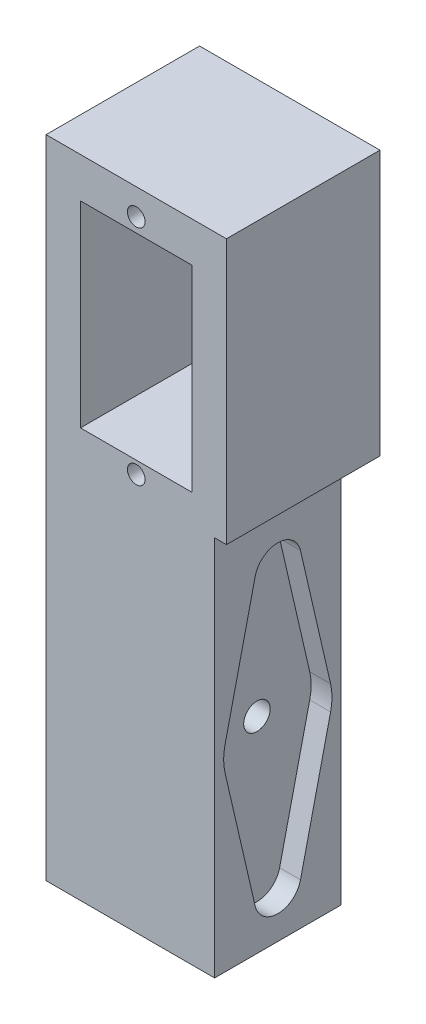
ISO-10303-21;
HEADER;
FILE_DESCRIPTION(('STEP AP214'),'2;1');
FILE_NAME('part.step','',(''),(''),'','','');
FILE_SCHEMA(('AUTOMOTIVE_DESIGN { 1 0 10303 214 1 1 1 1 }'));
ENDSEC;
DATA;
#1=APPLICATION_CONTEXT('core data for automotive mechanical design processes');
#2=APPLICATION_PROTOCOL_DEFINITION('international standard','automotive_design',2000,#1);
#3=PRODUCT_CONTEXT('',#1,'mechanical');
#4=PRODUCT('Part','Part','',(#3));
#5=PRODUCT_RELATED_PRODUCT_CATEGORY('part','',(#4));
#6=PRODUCT_DEFINITION_FORMATION('','',#4);
#7=PRODUCT_DEFINITION_CONTEXT('part definition',#1,'design');
#8=PRODUCT_DEFINITION('design','',#6,#7);
#9=PRODUCT_DEFINITION_SHAPE('','',#8);
#10=(LENGTH_UNIT() NAMED_UNIT(*) SI_UNIT(.MILLI.,.METRE.));
#11=(NAMED_UNIT(*) PLANE_ANGLE_UNIT() SI_UNIT($,.RADIAN.));
#12=(NAMED_UNIT(*) SI_UNIT($,.STERADIAN.) SOLID_ANGLE_UNIT());
#13=UNCERTAINTY_MEASURE_WITH_UNIT(LENGTH_MEASURE(1.E-05),#10,'distance_accuracy_value','');
#14=(GEOMETRIC_REPRESENTATION_CONTEXT(3) GLOBAL_UNCERTAINTY_ASSIGNED_CONTEXT((#13)) GLOBAL_UNIT_ASSIGNED_CONTEXT((#10,
#11,#12)) REPRESENTATION_CONTEXT('',''));
#15=CARTESIAN_POINT('',(0.,0.,0.));
#16=DIRECTION('',(0.,0.,1.));
#17=DIRECTION('',(1.,0.,0.));
#18=AXIS2_PLACEMENT_3D('',#15,#16,#17);
#19=CARTESIAN_POINT('',(-36.35,13.,-6.87499999999982));
#20=DIRECTION('',(1.,0.,0.));
#21=DIRECTION('',(0.,0.,-1.));
#22=AXIS2_PLACEMENT_3D('',#19,#20,#21);
#23=CYLINDRICAL_SURFACE('',#22,1.65);
#24=CARTESIAN_POINT('',(-7.34999999999999,13.,-6.87499999999992));
#25=DIRECTION('',(1.,0.,0.));
#26=DIRECTION('',(0.,0.,-1.));
#27=AXIS2_PLACEMENT_3D('',#24,#25,#26);
#28=CIRCLE('',#27,1.65);
#29=CARTESIAN_POINT('',(-7.34999999999999,13.,-8.52499999999993));
#30=VERTEX_POINT('',#29);
#31=EDGE_CURVE('E292',#30,#30,#28,.T.);
#32=ORIENTED_EDGE('',*,*,#31,.F.);
#33=EDGE_LOOP('',(#32));
#34=FACE_BOUND('',#33,.T.);
#35=CARTESIAN_POINT('',(11.05,13.,-6.87499999999999));
#36=DIRECTION('',(1.,0.,0.));
#37=DIRECTION('',(0.,0.,-1.));
#38=AXIS2_PLACEMENT_3D('',#35,#36,#37);
#39=CIRCLE('',#38,1.65);
#40=CARTESIAN_POINT('',(11.05,13.,-8.52499999999999));
#41=VERTEX_POINT('',#40);
#42=EDGE_CURVE('E40',#41,#41,#39,.F.);
#43=ORIENTED_EDGE('',*,*,#42,.F.);
#44=EDGE_LOOP('',(#43));
#45=FACE_BOUND('',#44,.T.);
#46=ADVANCED_FACE('F36',(#34,#45),#23,.F.);
#47=CARTESIAN_POINT('',(0.,0.,1.));
#48=DIRECTION('',(0.,0.,1.));
#49=DIRECTION('',(1.,0.,0.));
#50=AXIS2_PLACEMENT_3D('',#47,#48,#49);
#51=PLANE('',#50);
#52=CARTESIAN_POINT('',(3.88750000000004,67.25,1.));
#53=DIRECTION('',(0.,0.,1.));
#54=DIRECTION('',(1.,0.,0.));
#55=AXIS2_PLACEMENT_3D('',#52,#53,#54);
#56=CIRCLE('',#55,1.1);
#57=CARTESIAN_POINT('',(4.98750000000004,67.25,1.));
#58=VERTEX_POINT('',#57);
#59=EDGE_CURVE('E380',#58,#58,#56,.T.);
#60=ORIENTED_EDGE('',*,*,#59,.F.);
#61=EDGE_LOOP('',(#60));
#62=FACE_BOUND('',#61,.T.);
#63=CARTESIAN_POINT('',(3.88750000000004,39.45,1.));
#64=DIRECTION('',(0.,0.,1.));
#65=DIRECTION('',(1.,0.,0.));
#66=AXIS2_PLACEMENT_3D('',#63,#64,#65);
#67=CIRCLE('',#66,1.1);
#68=CARTESIAN_POINT('',(4.98750000000004,39.45,1.));
#69=VERTEX_POINT('',#68);
#70=EDGE_CURVE('E385',#69,#69,#67,.T.);
#71=ORIENTED_EDGE('',*,*,#70,.F.);
#72=EDGE_LOOP('',(#71));
#73=FACE_BOUND('',#72,.T.);
#74=DIRECTION('',(-1.,0.,0.));
#75=VECTOR('',#74,1.);
#76=CARTESIAN_POINT('',(-1.,-10.,1.));
#77=LINE('',#76,#75);
#78=CARTESIAN_POINT('',(13.65,-10.,1.));
#79=VERTEX_POINT('',#78);
#80=CARTESIAN_POINT('',(-7.34999999999996,-10.,1.));
#81=VERTEX_POINT('',#80);
#82=EDGE_CURVE('E288',#79,#81,#77,.T.);
#83=ORIENTED_EDGE('',*,*,#82,.F.);
#84=DIRECTION('',(0.,1.,0.));
#85=VECTOR('',#84,1.);
#86=CARTESIAN_POINT('',(13.65,37.5,1.));
#87=LINE('',#86,#85);
#88=CARTESIAN_POINT('',(13.65,37.5,1.));
#89=VERTEX_POINT('',#88);
#90=EDGE_CURVE('E404',#79,#89,#87,.T.);
#91=ORIENTED_EDGE('',*,*,#90,.T.);
#92=DIRECTION('',(1.,0.,0.));
#93=VECTOR('',#92,1.);
#94=CARTESIAN_POINT('',(-7.34999999999996,37.5,1.));
#95=LINE('',#94,#93);
#96=CARTESIAN_POINT('',(15.125,37.5,1.));
#97=VERTEX_POINT('',#96);
#98=EDGE_CURVE('E407',#89,#97,#95,.T.);
#99=ORIENTED_EDGE('',*,*,#98,.T.);
#100=DIRECTION('',(0.,1.,0.));
#101=VECTOR('',#100,1.);
#102=CARTESIAN_POINT('',(15.125,37.5,1.));
#103=LINE('',#102,#101);
#104=CARTESIAN_POINT('',(15.125,70.5,1.));
#105=VERTEX_POINT('',#104);
#106=EDGE_CURVE('E409',#97,#105,#103,.T.);
#107=ORIENTED_EDGE('',*,*,#106,.T.);
#108=DIRECTION('',(1.,0.,0.));
#109=VECTOR('',#108,1.);
#110=CARTESIAN_POINT('',(15.125,70.5,1.));
#111=LINE('',#110,#109);
#112=CARTESIAN_POINT('',(-7.34999999999996,70.5,1.));
#113=VERTEX_POINT('',#112);
#114=EDGE_CURVE('E401',#113,#105,#111,.T.);
#115=ORIENTED_EDGE('',*,*,#114,.F.);
#116=DIRECTION('',(0.,-1.,0.));
#117=VECTOR('',#116,1.);
#118=CARTESIAN_POINT('',(-7.34999999999996,68.5,1.));
#119=LINE('',#118,#117);
#120=EDGE_CURVE('E411',#113,#81,#119,.T.);
#121=ORIENTED_EDGE('',*,*,#120,.T.);
#122=EDGE_LOOP('',(#83,#91,#99,#107,#115,#121));
#123=FACE_BOUND('',#122,.T.);
#124=DIRECTION('',(0.,1.,0.));
#125=VECTOR('',#124,1.);
#126=CARTESIAN_POINT('',(10.8375,0.,1.));
#127=LINE('',#126,#125);
#128=CARTESIAN_POINT('',(10.8375,41.,1.));
#129=VERTEX_POINT('',#128);
#130=CARTESIAN_POINT('',(10.8375,65.5,1.));
#131=VERTEX_POINT('',#130);
#132=EDGE_CURVE('E320',#129,#131,#127,.T.);
#133=ORIENTED_EDGE('',*,*,#132,.F.);
#134=DIRECTION('',(-1.,0.,0.));
#135=VECTOR('',#134,1.);
#136=CARTESIAN_POINT('',(0.,41.,1.));
#137=LINE('',#136,#135);
#138=CARTESIAN_POINT('',(-3.06249999999996,41.,1.));
#139=VERTEX_POINT('',#138);
#140=EDGE_CURVE('E317',#129,#139,#137,.T.);
#141=ORIENTED_EDGE('',*,*,#140,.T.);
#142=DIRECTION('',(0.,1.,0.));
#143=VECTOR('',#142,1.);
#144=CARTESIAN_POINT('',(-3.06249999999996,0.,1.));
#145=LINE('',#144,#143);
#146=CARTESIAN_POINT('',(-3.06249999999996,65.5,1.));
#147=VERTEX_POINT('',#146);
#148=EDGE_CURVE('E314',#139,#147,#145,.T.);
#149=ORIENTED_EDGE('',*,*,#148,.T.);
#150=DIRECTION('',(1.,0.,0.));
#151=VECTOR('',#150,1.);
#152=CARTESIAN_POINT('',(0.,65.5,1.));
#153=LINE('',#152,#151);
#154=EDGE_CURVE('E61',#147,#131,#153,.T.);
#155=ORIENTED_EDGE('',*,*,#154,.T.);
#156=EDGE_LOOP('',(#133,#141,#149,#155));
#157=FACE_BOUND('',#156,.T.);
#158=ADVANCED_FACE('F453',(#62,#73,#123,#157),#51,.T.);
#159=CARTESIAN_POINT('',(0.,0.,-14.625));
#160=DIRECTION('',(0.,0.,-1.));
#161=DIRECTION('',(-1.,0.,0.));
#162=AXIS2_PLACEMENT_3D('',#159,#160,#161);
#163=PLANE('',#162);
#164=DIRECTION('',(0.,-1.,0.));
#165=VECTOR('',#164,1.);
#166=CARTESIAN_POINT('',(-1.61249999999995,0.,-14.625));
#167=LINE('',#166,#165);
#168=CARTESIAN_POINT('',(-1.61249999999996,64.5,-14.625));
#169=VERTEX_POINT('',#168);
#170=CARTESIAN_POINT('',(-1.61249999999996,59.5,-14.625));
#171=VERTEX_POINT('',#170);
#172=EDGE_CURVE('E362',#169,#171,#167,.T.);
#173=ORIENTED_EDGE('',*,*,#172,.F.);
#174=DIRECTION('',(1.,0.,0.));
#175=VECTOR('',#174,1.);
#176=CARTESIAN_POINT('',(0.,64.5,-14.625));
#177=LINE('',#176,#175);
#178=CARTESIAN_POINT('',(9.38750000000004,64.5,-14.625));
#179=VERTEX_POINT('',#178);
#180=EDGE_CURVE('E327',#169,#179,#177,.T.);
#181=ORIENTED_EDGE('',*,*,#180,.T.);
#182=DIRECTION('',(0.,1.,0.));
#183=VECTOR('',#182,1.);
#184=CARTESIAN_POINT('',(9.38750000000004,0.,-14.625));
#185=LINE('',#184,#183);
#186=CARTESIAN_POINT('',(9.38750000000004,59.5,-14.625));
#187=VERTEX_POINT('',#186);
#188=EDGE_CURVE('E359',#187,#179,#185,.T.);
#189=ORIENTED_EDGE('',*,*,#188,.F.);
#190=DIRECTION('',(1.,0.,0.));
#191=VECTOR('',#190,1.);
#192=CARTESIAN_POINT('',(0.,59.5,-14.625));
#193=LINE('',#192,#191);
#194=EDGE_CURVE('E334',#171,#187,#193,.T.);
#195=ORIENTED_EDGE('',*,*,#194,.F.);
#196=EDGE_LOOP('',(#173,#181,#189,#195));
#197=FACE_BOUND('',#196,.T.);
#198=DIRECTION('',(0.,-1.,0.));
#199=VECTOR('',#198,1.);
#200=CARTESIAN_POINT('',(9.38750000000004,0.,-14.625));
#201=LINE('',#200,#199);
#202=CARTESIAN_POINT('',(9.38750000000004,47.,-14.625));
#203=VERTEX_POINT('',#202);
#204=CARTESIAN_POINT('',(9.38750000000004,42.,-14.625));
#205=VERTEX_POINT('',#204);
#206=EDGE_CURVE('E335',#203,#205,#201,.T.);
#207=ORIENTED_EDGE('',*,*,#206,.T.);
#208=DIRECTION('',(-1.,0.,0.));
#209=VECTOR('',#208,1.);
#210=CARTESIAN_POINT('',(0.,42.,-14.625));
#211=LINE('',#210,#209);
#212=CARTESIAN_POINT('',(-1.61249999999996,42.,-14.625));
#213=VERTEX_POINT('',#212);
#214=EDGE_CURVE('E301',#205,#213,#211,.T.);
#215=ORIENTED_EDGE('',*,*,#214,.T.);
#216=DIRECTION('',(0.,1.,0.));
#217=VECTOR('',#216,1.);
#218=CARTESIAN_POINT('',(-1.61249999999996,0.,-14.625));
#219=LINE('',#218,#217);
#220=CARTESIAN_POINT('',(-1.61249999999996,47.,-14.625));
#221=VERTEX_POINT('',#220);
#222=EDGE_CURVE('E342',#213,#221,#219,.T.);
#223=ORIENTED_EDGE('',*,*,#222,.T.);
#224=DIRECTION('',(1.,0.,0.));
#225=VECTOR('',#224,1.);
#226=CARTESIAN_POINT('',(0.,47.,-14.625));
#227=LINE('',#226,#225);
#228=EDGE_CURVE('E338',#221,#203,#227,.T.);
#229=ORIENTED_EDGE('',*,*,#228,.T.);
#230=EDGE_LOOP('',(#207,#215,#223,#229));
#231=FACE_BOUND('',#230,.T.);
#232=DIRECTION('',(-1.,0.,0.));
#233=VECTOR('',#232,1.);
#234=CARTESIAN_POINT('',(0.,41.,-14.625));
#235=LINE('',#234,#233);
#236=CARTESIAN_POINT('',(10.8375,41.,-14.625));
#237=VERTEX_POINT('',#236);
#238=CARTESIAN_POINT('',(-3.06249999999996,41.,-14.625));
#239=VERTEX_POINT('',#238);
#240=EDGE_CURVE('E303',#237,#239,#235,.T.);
#241=ORIENTED_EDGE('',*,*,#240,.F.);
#242=DIRECTION('',(0.,1.,0.));
#243=VECTOR('',#242,1.);
#244=CARTESIAN_POINT('',(10.8375,0.,-14.625));
#245=LINE('',#244,#243);
#246=CARTESIAN_POINT('',(10.8375,65.5,-14.625));
#247=VERTEX_POINT('',#246);
#248=EDGE_CURVE('E306',#237,#247,#245,.T.);
#249=ORIENTED_EDGE('',*,*,#248,.T.);
#250=DIRECTION('',(1.,0.,0.));
#251=VECTOR('',#250,1.);
#252=CARTESIAN_POINT('',(0.,65.5,-14.625));
#253=LINE('',#252,#251);
#254=CARTESIAN_POINT('',(-3.06249999999996,65.5,-14.625));
#255=VERTEX_POINT('',#254);
#256=EDGE_CURVE('E308',#255,#247,#253,.T.);
#257=ORIENTED_EDGE('',*,*,#256,.F.);
#258=DIRECTION('',(0.,1.,0.));
#259=VECTOR('',#258,1.);
#260=CARTESIAN_POINT('',(-3.06249999999996,0.,-14.625));
#261=LINE('',#260,#259);
#262=EDGE_CURVE('E311',#239,#255,#261,.T.);
#263=ORIENTED_EDGE('',*,*,#262,.F.);
#264=EDGE_LOOP('',(#241,#249,#257,#263));
#265=FACE_BOUND('',#264,.T.);
#266=ADVANCED_FACE('F459',(#197,#231,#265),#163,.F.);
#267=CARTESIAN_POINT('',(0.,0.,-18.125));
#268=DIRECTION('',(0.,0.,1.));
#269=DIRECTION('',(1.,0.,0.));
#270=AXIS2_PLACEMENT_3D('',#267,#268,#269);
#271=PLANE('',#270);
#272=DIRECTION('',(-1.,0.,0.));
#273=VECTOR('',#272,1.);
#274=CARTESIAN_POINT('',(-7.34999999999997,37.5,-18.125));
#275=LINE('',#274,#273);
#276=CARTESIAN_POINT('',(15.125,37.5,-18.125));
#277=VERTEX_POINT('',#276);
#278=CARTESIAN_POINT('',(-7.34999999999997,37.5,-18.125));
#279=VERTEX_POINT('',#278);
#280=EDGE_CURVE('E413',#277,#279,#275,.T.);
#281=ORIENTED_EDGE('',*,*,#280,.T.);
#282=DIRECTION('',(0.,1.,0.));
#283=VECTOR('',#282,1.);
#284=CARTESIAN_POINT('',(-7.34999999999996,68.5,-18.125));
#285=LINE('',#284,#283);
#286=CARTESIAN_POINT('',(-7.34999999999996,70.5,-18.125));
#287=VERTEX_POINT('',#286);
#288=EDGE_CURVE('E416',#279,#287,#285,.T.);
#289=ORIENTED_EDGE('',*,*,#288,.T.);
#290=DIRECTION('',(-1.,0.,0.));
#291=VECTOR('',#290,1.);
#292=CARTESIAN_POINT('',(-7.34999999999996,70.5,-18.125));
#293=LINE('',#292,#291);
#294=CARTESIAN_POINT('',(15.125,70.5,-18.125));
#295=VERTEX_POINT('',#294);
#296=EDGE_CURVE('E395',#295,#287,#293,.T.);
#297=ORIENTED_EDGE('',*,*,#296,.F.);
#298=DIRECTION('',(0.,-1.,0.));
#299=VECTOR('',#298,1.);
#300=CARTESIAN_POINT('',(15.125,37.5,-18.125));
#301=LINE('',#300,#299);
#302=EDGE_CURVE('E418',#295,#277,#301,.T.);
#303=ORIENTED_EDGE('',*,*,#302,.T.);
#304=EDGE_LOOP('',(#281,#289,#297,#303));
#305=FACE_BOUND('',#304,.T.);
#306=DIRECTION('',(0.,-1.,0.));
#307=VECTOR('',#306,1.);
#308=CARTESIAN_POINT('',(-1.61249999999995,0.,-18.125));
#309=LINE('',#308,#307);
#310=CARTESIAN_POINT('',(-1.61249999999996,64.5,-18.125));
#311=VERTEX_POINT('',#310);
#312=CARTESIAN_POINT('',(-1.61249999999996,59.5,-18.125));
#313=VERTEX_POINT('',#312);
#314=EDGE_CURVE('E434',#311,#313,#309,.T.);
#315=ORIENTED_EDGE('',*,*,#314,.T.);
#316=DIRECTION('',(1.,0.,0.));
#317=VECTOR('',#316,1.);
#318=CARTESIAN_POINT('',(0.,59.5,-18.125));
#319=LINE('',#318,#317);
#320=CARTESIAN_POINT('',(9.38750000000004,59.5,-18.125));
#321=VERTEX_POINT('',#320);
#322=EDGE_CURVE('E437',#313,#321,#319,.T.);
#323=ORIENTED_EDGE('',*,*,#322,.T.);
#324=DIRECTION('',(0.,1.,0.));
#325=VECTOR('',#324,1.);
#326=CARTESIAN_POINT('',(9.38750000000004,0.,-18.125));
#327=LINE('',#326,#325);
#328=CARTESIAN_POINT('',(9.38750000000004,64.5,-18.125));
#329=VERTEX_POINT('',#328);
#330=EDGE_CURVE('E428',#321,#329,#327,.T.);
#331=ORIENTED_EDGE('',*,*,#330,.T.);
#332=DIRECTION('',(-1.,0.,0.));
#333=VECTOR('',#332,1.);
#334=CARTESIAN_POINT('',(0.,64.5,-18.125));
#335=LINE('',#334,#333);
#336=EDGE_CURVE('E431',#329,#311,#335,.T.);
#337=ORIENTED_EDGE('',*,*,#336,.T.);
#338=EDGE_LOOP('',(#315,#323,#331,#337));
#339=FACE_BOUND('',#338,.T.);
#340=DIRECTION('',(0.,-1.,0.));
#341=VECTOR('',#340,1.);
#342=CARTESIAN_POINT('',(9.38750000000004,0.,-18.125));
#343=LINE('',#342,#341);
#344=CARTESIAN_POINT('',(9.38750000000004,47.,-18.125));
#345=VERTEX_POINT('',#344);
#346=CARTESIAN_POINT('',(9.38750000000004,42.,-18.125));
#347=VERTEX_POINT('',#346);
#348=EDGE_CURVE('E12',#345,#347,#343,.T.);
#349=ORIENTED_EDGE('',*,*,#348,.F.);
#350=DIRECTION('',(1.,0.,0.));
#351=VECTOR('',#350,1.);
#352=CARTESIAN_POINT('',(0.,47.,-18.125));
#353=LINE('',#352,#351);
#354=CARTESIAN_POINT('',(-1.61249999999996,47.,-18.125));
#355=VERTEX_POINT('',#354);
#356=EDGE_CURVE('E440',#355,#345,#353,.T.);
#357=ORIENTED_EDGE('',*,*,#356,.F.);
#358=DIRECTION('',(0.,1.,0.));
#359=VECTOR('',#358,1.);
#360=CARTESIAN_POINT('',(-1.61249999999996,0.,-18.125));
#361=LINE('',#360,#359);
#362=CARTESIAN_POINT('',(-1.61249999999996,42.,-18.125));
#363=VERTEX_POINT('',#362);
#364=EDGE_CURVE('E442',#363,#355,#361,.T.);
#365=ORIENTED_EDGE('',*,*,#364,.F.);
#366=DIRECTION('',(1.,0.,0.));
#367=VECTOR('',#366,1.);
#368=CARTESIAN_POINT('',(0.,42.,-18.125));
#369=LINE('',#368,#367);
#370=EDGE_CURVE('E45',#363,#347,#369,.T.);
#371=ORIENTED_EDGE('',*,*,#370,.T.);
#372=EDGE_LOOP('',(#349,#357,#365,#371));
#373=FACE_BOUND('',#372,.T.);
#374=ADVANCED_FACE('F532',(#305,#339,#373),#271,.F.);
#375=CARTESIAN_POINT('',(-1.,37.5,-38.9531761207504));
#376=DIRECTION('',(0.,-1.,0.));
#377=DIRECTION('',(0.,0.,-1.));
#378=AXIS2_PLACEMENT_3D('',#375,#376,#377);
#379=PLANE('',#378);
#380=DIRECTION('',(0.,0.,-1.));
#381=VECTOR('',#380,1.);
#382=CARTESIAN_POINT('',(13.65,37.5,0.));
#383=LINE('',#382,#381);
#384=CARTESIAN_POINT('',(13.65,37.5,-14.75));
#385=VERTEX_POINT('',#384);
#386=EDGE_CURVE('E426',#89,#385,#383,.T.);
#387=ORIENTED_EDGE('',*,*,#386,.T.);
#388=DIRECTION('',(1.,0.,0.));
#389=VECTOR('',#388,1.);
#390=CARTESIAN_POINT('',(-7.35,37.5,-14.75));
#391=LINE('',#390,#389);
#392=CARTESIAN_POINT('',(-7.35,37.5,-14.75));
#393=VERTEX_POINT('',#392);
#394=EDGE_CURVE('E377',#393,#385,#391,.T.);
#395=ORIENTED_EDGE('',*,*,#394,.F.);
#396=DIRECTION('',(0.,0.,-1.));
#397=VECTOR('',#396,1.);
#398=CARTESIAN_POINT('',(-7.34999999999997,37.5,-4.92559526405419));
#399=LINE('',#398,#397);
#400=EDGE_CURVE('E421',#393,#279,#399,.T.);
#401=ORIENTED_EDGE('',*,*,#400,.T.);
#402=ORIENTED_EDGE('',*,*,#280,.F.);
#403=DIRECTION('',(0.,0.,1.));
#404=VECTOR('',#403,1.);
#405=CARTESIAN_POINT('',(15.125,37.5,-38.9531761207504));
#406=LINE('',#405,#404);
#407=EDGE_CURVE('E423',#277,#97,#406,.T.);
#408=ORIENTED_EDGE('',*,*,#407,.T.);
#409=ORIENTED_EDGE('',*,*,#98,.F.);
#410=EDGE_LOOP('',(#387,#395,#401,#402,#408,#409));
#411=FACE_BOUND('',#410,.T.);
#412=ADVANCED_FACE('F535',(#411),#379,.T.);
#413=CARTESIAN_POINT('',(13.65,0.,0.));
#414=DIRECTION('',(1.,0.,0.));
#415=DIRECTION('',(0.,0.,-1.));
#416=AXIS2_PLACEMENT_3D('',#413,#414,#415);
#417=PLANE('',#416);
#418=CARTESIAN_POINT('',(13.65,-4.1,-6.875));
#419=DIRECTION('',(1.,0.,0.));
#420=DIRECTION('',(0.,0.,-1.));
#421=AXIS2_PLACEMENT_3D('',#418,#419,#420);
#422=CIRCLE('',#421,2.9);
#423=CARTESIAN_POINT('',(13.65,-4.75292397660819,-4.04945752451496));
#424=VERTEX_POINT('',#423);
#425=CARTESIAN_POINT('',(13.65,-4.75292397660819,-9.70054247548505));
#426=VERTEX_POINT('',#425);
#427=EDGE_CURVE('E53',#424,#426,#422,.T.);
#428=ORIENTED_EDGE('',*,*,#427,.F.);
#429=DIRECTION('',(0.,-0.974324991546567,-0.22514619883041));
#430=VECTOR('',#429,1.);
#431=CARTESIAN_POINT('',(13.65,-4.75292397660819,-4.04945752451496));
#432=LINE('',#431,#430);
#433=CARTESIAN_POINT('',(13.65,11.4802631578947,-0.298306307060673));
#434=VERTEX_POINT('',#433);
#435=EDGE_CURVE('E239',#434,#424,#432,.T.);
#436=ORIENTED_EDGE('',*,*,#435,.F.);
#437=CARTESIAN_POINT('',(13.65,13.,-6.875));
#438=DIRECTION('',(1.,0.,0.));
#439=DIRECTION('',(0.,0.,-1.));
#440=AXIS2_PLACEMENT_3D('',#437,#438,#439);
#441=CIRCLE('',#440,6.75);
#442=CARTESIAN_POINT('',(13.65,14.5173795873099,-0.297762039578077));
#443=VERTEX_POINT('',#442);
#444=EDGE_CURVE('E242',#443,#434,#441,.T.);
#445=ORIENTED_EDGE('',*,*,#444,.F.);
#446=DIRECTION('',(0.,-0.974405623766211,0.224796975897769));
#447=VECTOR('',#446,1.);
#448=CARTESIAN_POINT('',(13.65,14.5173795873099,-0.297762039578078));
#449=LINE('',#448,#447);
#450=CARTESIAN_POINT('',(13.65,30.7784761432849,-4.04922369107799));
#451=VERTEX_POINT('',#450);
#452=EDGE_CURVE('E270',#451,#443,#449,.T.);
#453=ORIENTED_EDGE('',*,*,#452,.F.);
#454=CARTESIAN_POINT('',(13.65,30.1265649131813,-6.875));
#455=DIRECTION('',(1.,0.,0.));
#456=DIRECTION('',(0.,0.,-1.));
#457=AXIS2_PLACEMENT_3D('',#454,#455,#456);
#458=CIRCLE('',#457,2.9);
#459=CARTESIAN_POINT('',(13.65,30.7784761432849,-9.70077630892201));
#460=VERTEX_POINT('',#459);
#461=EDGE_CURVE('E267',#460,#451,#458,.T.);
#462=ORIENTED_EDGE('',*,*,#461,.F.);
#463=DIRECTION('',(0.,0.974405623766211,0.224796975897769));
#464=VECTOR('',#463,1.);
#465=CARTESIAN_POINT('',(13.65,14.5173795873099,-13.4522379604219));
#466=LINE('',#465,#464);
#467=CARTESIAN_POINT('',(13.65,14.5173795873099,-13.4522379604219));
#468=VERTEX_POINT('',#467);
#469=EDGE_CURVE('E264',#468,#460,#466,.T.);
#470=ORIENTED_EDGE('',*,*,#469,.F.);
#471=CARTESIAN_POINT('',(13.65,13.,-6.875));
#472=DIRECTION('',(1.,0.,0.));
#473=DIRECTION('',(0.,0.,-1.));
#474=AXIS2_PLACEMENT_3D('',#471,#472,#473);
#475=CIRCLE('',#474,6.75);
#476=CARTESIAN_POINT('',(13.65,11.4802631578947,-13.4516936929393));
#477=VERTEX_POINT('',#476);
#478=EDGE_CURVE('E261',#477,#468,#475,.T.);
#479=ORIENTED_EDGE('',*,*,#478,.F.);
#480=DIRECTION('',(0.,0.974324991546567,-0.225146198830409));
#481=VECTOR('',#480,1.);
#482=CARTESIAN_POINT('',(13.65,-4.75292397660819,-9.70054247548505));
#483=LINE('',#482,#481);
#484=EDGE_CURVE('E259',#426,#477,#483,.T.);
#485=ORIENTED_EDGE('',*,*,#484,.F.);
#486=EDGE_LOOP('',(#428,#436,#445,#453,#462,#470,#479,#485));
#487=FACE_BOUND('',#486,.T.);
#488=ORIENTED_EDGE('',*,*,#386,.F.);
#489=ORIENTED_EDGE('',*,*,#90,.F.);
#490=DIRECTION('',(0.,0.,1.));
#491=VECTOR('',#490,1.);
#492=CARTESIAN_POINT('',(13.65,-10.,-14.75));
#493=LINE('',#492,#491);
#494=CARTESIAN_POINT('',(13.65,-10.,-14.75));
#495=VERTEX_POINT('',#494);
#496=EDGE_CURVE('E298',#495,#79,#493,.T.);
#497=ORIENTED_EDGE('',*,*,#496,.F.);
#498=DIRECTION('',(0.,-1.,0.));
#499=VECTOR('',#498,1.);
#500=CARTESIAN_POINT('',(13.65,37.5,-14.75));
#501=LINE('',#500,#499);
#502=EDGE_CURVE('E349',#385,#495,#501,.T.);
#503=ORIENTED_EDGE('',*,*,#502,.F.);
#504=EDGE_LOOP('',(#488,#489,#497,#503));
#505=FACE_BOUND('',#504,.T.);
#506=ADVANCED_FACE('F539',(#487,#505),#417,.T.);
#507=CARTESIAN_POINT('',(15.125,0.,0.));
#508=DIRECTION('',(1.,0.,0.));
#509=DIRECTION('',(0.,0.,-1.));
#510=AXIS2_PLACEMENT_3D('',#507,#508,#509);
#511=PLANE('',#510);
#512=ORIENTED_EDGE('',*,*,#302,.F.);
#513=DIRECTION('',(0.,0.,-1.));
#514=VECTOR('',#513,1.);
#515=CARTESIAN_POINT('',(15.125,70.5,-18.125));
#516=LINE('',#515,#514);
#517=EDGE_CURVE('E384',#105,#295,#516,.T.);
#518=ORIENTED_EDGE('',*,*,#517,.F.);
#519=ORIENTED_EDGE('',*,*,#106,.F.);
#520=ORIENTED_EDGE('',*,*,#407,.F.);
#521=EDGE_LOOP('',(#512,#518,#519,#520));
#522=FACE_BOUND('',#521,.T.);
#523=ADVANCED_FACE('F545',(#522),#511,.T.);
#524=CARTESIAN_POINT('',(-7.34999999999996,0.,0.));
#525=DIRECTION('',(1.,0.,0.));
#526=DIRECTION('',(0.,0.,-1.));
#527=AXIS2_PLACEMENT_3D('',#524,#525,#526);
#528=PLANE('',#527);
#529=ORIENTED_EDGE('',*,*,#31,.T.);
#530=EDGE_LOOP('',(#529));
#531=FACE_BOUND('',#530,.T.);
#532=ORIENTED_EDGE('',*,*,#400,.F.);
#533=DIRECTION('',(0.,1.,0.));
#534=VECTOR('',#533,1.);
#535=CARTESIAN_POINT('',(-7.35,0.,-14.75));
#536=LINE('',#535,#534);
#537=CARTESIAN_POINT('',(-7.35,-10.,-14.75));
#538=VERTEX_POINT('',#537);
#539=EDGE_CURVE('E375',#538,#393,#536,.T.);
#540=ORIENTED_EDGE('',*,*,#539,.F.);
#541=DIRECTION('',(0.,0.,-1.));
#542=VECTOR('',#541,1.);
#543=CARTESIAN_POINT('',(-7.34999999999996,-10.,1.));
#544=LINE('',#543,#542);
#545=EDGE_CURVE('E291',#81,#538,#544,.T.);
#546=ORIENTED_EDGE('',*,*,#545,.F.);
#547=ORIENTED_EDGE('',*,*,#120,.F.);
#548=DIRECTION('',(0.,0.,1.));
#549=VECTOR('',#548,1.);
#550=CARTESIAN_POINT('',(-7.34999999999996,70.5,1.));
#551=LINE('',#550,#549);
#552=EDGE_CURVE('E398',#287,#113,#551,.T.);
#553=ORIENTED_EDGE('',*,*,#552,.F.);
#554=ORIENTED_EDGE('',*,*,#288,.F.);
#555=EDGE_LOOP('',(#532,#540,#546,#547,#553,#554));
#556=FACE_BOUND('',#555,.T.);
#557=ADVANCED_FACE('F541',(#531,#556),#528,.F.);
#558=CARTESIAN_POINT('',(0.,64.5,0.));
#559=DIRECTION('',(0.,-1.,0.));
#560=DIRECTION('',(0.,0.,-1.));
#561=AXIS2_PLACEMENT_3D('',#558,#559,#560);
#562=PLANE('',#561);
#563=ORIENTED_EDGE('',*,*,#180,.F.);
#564=DIRECTION('',(0.,0.,1.));
#565=VECTOR('',#564,1.);
#566=CARTESIAN_POINT('',(-1.61249999999996,64.5,-24.625));
#567=LINE('',#566,#565);
#568=EDGE_CURVE('E367',#311,#169,#567,.T.);
#569=ORIENTED_EDGE('',*,*,#568,.F.);
#570=ORIENTED_EDGE('',*,*,#336,.F.);
#571=DIRECTION('',(0.,0.,1.));
#572=VECTOR('',#571,1.);
#573=CARTESIAN_POINT('',(9.38750000000004,64.5,-24.625));
#574=LINE('',#573,#572);
#575=EDGE_CURVE('E370',#329,#179,#574,.T.);
#576=ORIENTED_EDGE('',*,*,#575,.T.);
#577=EDGE_LOOP('',(#563,#569,#570,#576));
#578=FACE_BOUND('',#577,.T.);
#579=ADVANCED_FACE('F544',(#578),#562,.T.);
#580=CARTESIAN_POINT('',(0.,42.,0.));
#581=DIRECTION('',(0.,1.,0.));
#582=DIRECTION('',(0.,0.,1.));
#583=AXIS2_PLACEMENT_3D('',#580,#581,#582);
#584=PLANE('',#583);
#585=ORIENTED_EDGE('',*,*,#214,.F.);
#586=DIRECTION('',(0.,0.,1.));
#587=VECTOR('',#586,1.);
#588=CARTESIAN_POINT('',(9.38750000000004,42.,-24.625));
#589=LINE('',#588,#587);
#590=EDGE_CURVE('E346',#347,#205,#589,.T.);
#591=ORIENTED_EDGE('',*,*,#590,.F.);
#592=ORIENTED_EDGE('',*,*,#370,.F.);
#593=DIRECTION('',(0.,0.,1.));
#594=VECTOR('',#593,1.);
#595=CARTESIAN_POINT('',(-1.61249999999996,42.,-24.625));
#596=LINE('',#595,#594);
#597=EDGE_CURVE('E350',#363,#213,#596,.T.);
#598=ORIENTED_EDGE('',*,*,#597,.T.);
#599=EDGE_LOOP('',(#585,#591,#592,#598));
#600=FACE_BOUND('',#599,.T.);
#601=ADVANCED_FACE('F38',(#600),#584,.T.);
#602=CARTESIAN_POINT('',(0.,70.5,0.));
#603=DIRECTION('',(0.,-1.,0.));
#604=DIRECTION('',(0.,0.,-1.));
#605=AXIS2_PLACEMENT_3D('',#602,#603,#604);
#606=PLANE('',#605);
#607=ORIENTED_EDGE('',*,*,#517,.T.);
#608=ORIENTED_EDGE('',*,*,#296,.T.);
#609=ORIENTED_EDGE('',*,*,#552,.T.);
#610=ORIENTED_EDGE('',*,*,#114,.T.);
#611=EDGE_LOOP('',(#607,#608,#609,#610));
#612=FACE_BOUND('',#611,.T.);
#613=ADVANCED_FACE('F527',(#612),#606,.F.);
#614=CARTESIAN_POINT('',(3.88750000000004,67.25,-4.));
#615=DIRECTION('',(0.,0.,1.));
#616=DIRECTION('',(1.,0.,0.));
#617=AXIS2_PLACEMENT_3D('',#614,#615,#616);
#618=CYLINDRICAL_SURFACE('',#617,1.1);
#619=CARTESIAN_POINT('',(3.88750000000004,67.25,-4.));
#620=DIRECTION('',(0.,0.,1.));
#621=DIRECTION('',(1.,0.,0.));
#622=AXIS2_PLACEMENT_3D('',#619,#620,#621);
#623=CIRCLE('',#622,1.1);
#624=CARTESIAN_POINT('',(4.98750000000004,67.25,-4.));
#625=VERTEX_POINT('',#624);
#626=EDGE_CURVE('E388',#625,#625,#623,.T.);
#627=ORIENTED_EDGE('',*,*,#626,.F.);
#628=EDGE_LOOP('',(#627));
#629=FACE_BOUND('',#628,.T.);
#630=ORIENTED_EDGE('',*,*,#59,.T.);
#631=EDGE_LOOP('',(#630));
#632=FACE_BOUND('',#631,.T.);
#633=ADVANCED_FACE('F523',(#629,#632),#618,.F.);
#634=CARTESIAN_POINT('',(0.,0.,-4.));
#635=DIRECTION('',(0.,0.,1.));
#636=DIRECTION('',(1.,0.,0.));
#637=AXIS2_PLACEMENT_3D('',#634,#635,#636);
#638=PLANE('',#637);
#639=ORIENTED_EDGE('',*,*,#626,.T.);
#640=EDGE_LOOP('',(#639));
#641=FACE_BOUND('',#640,.T.);
#642=ADVANCED_FACE('F519',(#641),#638,.T.);
#643=CARTESIAN_POINT('',(3.88750000000004,39.45,-4.));
#644=DIRECTION('',(0.,0.,1.));
#645=DIRECTION('',(1.,0.,0.));
#646=AXIS2_PLACEMENT_3D('',#643,#644,#645);
#647=CYLINDRICAL_SURFACE('',#646,1.1);
#648=CARTESIAN_POINT('',(3.88750000000004,39.45,-4.));
#649=DIRECTION('',(0.,0.,1.));
#650=DIRECTION('',(1.,0.,0.));
#651=AXIS2_PLACEMENT_3D('',#648,#649,#650);
#652=CIRCLE('',#651,1.1);
#653=CARTESIAN_POINT('',(4.98750000000004,39.45,-4.));
#654=VERTEX_POINT('',#653);
#655=EDGE_CURVE('E381',#654,#654,#652,.T.);
#656=ORIENTED_EDGE('',*,*,#655,.F.);
#657=EDGE_LOOP('',(#656));
#658=FACE_BOUND('',#657,.T.);
#659=ORIENTED_EDGE('',*,*,#70,.T.);
#660=EDGE_LOOP('',(#659));
#661=FACE_BOUND('',#660,.T.);
#662=ADVANCED_FACE('F515',(#658,#661),#647,.F.);
#663=CARTESIAN_POINT('',(0.,0.,-4.));
#664=DIRECTION('',(0.,0.,1.));
#665=DIRECTION('',(1.,0.,0.));
#666=AXIS2_PLACEMENT_3D('',#663,#664,#665);
#667=PLANE('',#666);
#668=ORIENTED_EDGE('',*,*,#655,.T.);
#669=EDGE_LOOP('',(#668));
#670=FACE_BOUND('',#669,.T.);
#671=ADVANCED_FACE('F511',(#670),#667,.T.);
#672=CARTESIAN_POINT('',(0.,0.,-14.75));
#673=DIRECTION('',(0.,0.,-1.));
#674=DIRECTION('',(-1.,0.,0.));
#675=AXIS2_PLACEMENT_3D('',#672,#673,#674);
#676=PLANE('',#675);
#677=ORIENTED_EDGE('',*,*,#502,.T.);
#678=DIRECTION('',(1.,0.,0.));
#679=VECTOR('',#678,1.);
#680=CARTESIAN_POINT('',(-7.35,-10.,-14.75));
#681=LINE('',#680,#679);
#682=EDGE_CURVE('E295',#538,#495,#681,.T.);
#683=ORIENTED_EDGE('',*,*,#682,.F.);
#684=ORIENTED_EDGE('',*,*,#539,.T.);
#685=ORIENTED_EDGE('',*,*,#394,.T.);
#686=EDGE_LOOP('',(#677,#683,#684,#685));
#687=FACE_BOUND('',#686,.T.);
#688=ADVANCED_FACE('F507',(#687),#676,.T.);
#689=CARTESIAN_POINT('',(0.,59.5,-24.625));
#690=DIRECTION('',(0.,-1.,0.));
#691=DIRECTION('',(0.,0.,-1.));
#692=AXIS2_PLACEMENT_3D('',#689,#690,#691);
#693=PLANE('',#692);
#694=DIRECTION('',(0.,0.,1.));
#695=VECTOR('',#694,1.);
#696=CARTESIAN_POINT('',(-1.61249999999996,59.5,-24.625));
#697=LINE('',#696,#695);
#698=EDGE_CURVE('E339',#313,#171,#697,.T.);
#699=ORIENTED_EDGE('',*,*,#698,.T.);
#700=ORIENTED_EDGE('',*,*,#194,.T.);
#701=DIRECTION('',(0.,0.,1.));
#702=VECTOR('',#701,1.);
#703=CARTESIAN_POINT('',(9.38750000000004,59.5,-24.625));
#704=LINE('',#703,#702);
#705=EDGE_CURVE('E365',#321,#187,#704,.T.);
#706=ORIENTED_EDGE('',*,*,#705,.F.);
#707=ORIENTED_EDGE('',*,*,#322,.F.);
#708=EDGE_LOOP('',(#699,#700,#706,#707));
#709=FACE_BOUND('',#708,.T.);
#710=ADVANCED_FACE('F500',(#709),#693,.F.);
#711=CARTESIAN_POINT('',(-1.61249999999995,0.,-24.625));
#712=DIRECTION('',(-1.,0.,0.));
#713=DIRECTION('',(0.,-1.,0.));
#714=AXIS2_PLACEMENT_3D('',#711,#712,#713);
#715=PLANE('',#714);
#716=ORIENTED_EDGE('',*,*,#568,.T.);
#717=ORIENTED_EDGE('',*,*,#172,.T.);
#718=ORIENTED_EDGE('',*,*,#698,.F.);
#719=ORIENTED_EDGE('',*,*,#314,.F.);
#720=EDGE_LOOP('',(#716,#717,#718,#719));
#721=FACE_BOUND('',#720,.T.);
#722=ADVANCED_FACE('F497',(#721),#715,.F.);
#723=CARTESIAN_POINT('',(9.38750000000004,0.,-24.625));
#724=DIRECTION('',(1.,0.,0.));
#725=DIRECTION('',(0.,0.,-1.));
#726=AXIS2_PLACEMENT_3D('',#723,#724,#725);
#727=PLANE('',#726);
#728=ORIENTED_EDGE('',*,*,#705,.T.);
#729=ORIENTED_EDGE('',*,*,#188,.T.);
#730=ORIENTED_EDGE('',*,*,#575,.F.);
#731=ORIENTED_EDGE('',*,*,#330,.F.);
#732=EDGE_LOOP('',(#728,#729,#730,#731));
#733=FACE_BOUND('',#732,.T.);
#734=ADVANCED_FACE('F495',(#733),#727,.F.);
#735=CARTESIAN_POINT('',(9.38750000000004,0.,-24.625));
#736=DIRECTION('',(-1.,0.,0.));
#737=DIRECTION('',(0.,0.,1.));
#738=AXIS2_PLACEMENT_3D('',#735,#736,#737);
#739=PLANE('',#738);
#740=ORIENTED_EDGE('',*,*,#348,.T.);
#741=ORIENTED_EDGE('',*,*,#590,.T.);
#742=ORIENTED_EDGE('',*,*,#206,.F.);
#743=DIRECTION('',(0.,0.,1.));
#744=VECTOR('',#743,1.);
#745=CARTESIAN_POINT('',(9.38750000000004,47.,-24.625));
#746=LINE('',#745,#744);
#747=EDGE_CURVE('E345',#345,#203,#746,.T.);
#748=ORIENTED_EDGE('',*,*,#747,.F.);
#749=EDGE_LOOP('',(#740,#741,#742,#748));
#750=FACE_BOUND('',#749,.T.);
#751=ADVANCED_FACE('F488',(#750),#739,.T.);
#752=CARTESIAN_POINT('',(-1.61249999999996,0.,-24.625));
#753=DIRECTION('',(1.,0.,0.));
#754=DIRECTION('',(0.,0.,-1.));
#755=AXIS2_PLACEMENT_3D('',#752,#753,#754);
#756=PLANE('',#755);
#757=ORIENTED_EDGE('',*,*,#364,.T.);
#758=DIRECTION('',(0.,0.,1.));
#759=VECTOR('',#758,1.);
#760=CARTESIAN_POINT('',(-1.61249999999996,47.,-24.625));
#761=LINE('',#760,#759);
#762=EDGE_CURVE('E353',#355,#221,#761,.T.);
#763=ORIENTED_EDGE('',*,*,#762,.T.);
#764=ORIENTED_EDGE('',*,*,#222,.F.);
#765=ORIENTED_EDGE('',*,*,#597,.F.);
#766=EDGE_LOOP('',(#757,#763,#764,#765));
#767=FACE_BOUND('',#766,.T.);
#768=ADVANCED_FACE('F485',(#767),#756,.T.);
#769=CARTESIAN_POINT('',(0.,47.,-24.625));
#770=DIRECTION('',(0.,-1.,0.));
#771=DIRECTION('',(0.,0.,-1.));
#772=AXIS2_PLACEMENT_3D('',#769,#770,#771);
#773=PLANE('',#772);
#774=ORIENTED_EDGE('',*,*,#356,.T.);
#775=ORIENTED_EDGE('',*,*,#747,.T.);
#776=ORIENTED_EDGE('',*,*,#228,.F.);
#777=ORIENTED_EDGE('',*,*,#762,.F.);
#778=EDGE_LOOP('',(#774,#775,#776,#777));
#779=FACE_BOUND('',#778,.T.);
#780=ADVANCED_FACE('F480',(#779),#773,.T.);
#781=CARTESIAN_POINT('',(0.,41.,-42.7934220360318));
#782=DIRECTION('',(0.,1.,0.));
#783=DIRECTION('',(0.,0.,1.));
#784=AXIS2_PLACEMENT_3D('',#781,#782,#783);
#785=PLANE('',#784);
#786=ORIENTED_EDGE('',*,*,#240,.T.);
#787=DIRECTION('',(0.,0.,1.));
#788=VECTOR('',#787,1.);
#789=CARTESIAN_POINT('',(-3.06249999999996,41.,-42.7934220360318));
#790=LINE('',#789,#788);
#791=EDGE_CURVE('E324',#239,#139,#790,.T.);
#792=ORIENTED_EDGE('',*,*,#791,.T.);
#793=ORIENTED_EDGE('',*,*,#140,.F.);
#794=DIRECTION('',(0.,0.,1.));
#795=VECTOR('',#794,1.);
#796=CARTESIAN_POINT('',(10.8375,41.,-42.7934220360318));
#797=LINE('',#796,#795);
#798=EDGE_CURVE('E330',#237,#129,#797,.T.);
#799=ORIENTED_EDGE('',*,*,#798,.F.);
#800=EDGE_LOOP('',(#786,#792,#793,#799));
#801=FACE_BOUND('',#800,.T.);
#802=ADVANCED_FACE('F476',(#801),#785,.T.);
#803=CARTESIAN_POINT('',(10.8375,0.,-42.7934220360318));
#804=DIRECTION('',(1.,0.,0.));
#805=DIRECTION('',(0.,0.,-1.));
#806=AXIS2_PLACEMENT_3D('',#803,#804,#805);
#807=PLANE('',#806);
#808=ORIENTED_EDGE('',*,*,#798,.T.);
#809=ORIENTED_EDGE('',*,*,#132,.T.);
#810=DIRECTION('',(0.,0.,1.));
#811=VECTOR('',#810,1.);
#812=CARTESIAN_POINT('',(10.8375,65.5,-42.7934220360318));
#813=LINE('',#812,#811);
#814=EDGE_CURVE('E328',#247,#131,#813,.T.);
#815=ORIENTED_EDGE('',*,*,#814,.F.);
#816=ORIENTED_EDGE('',*,*,#248,.F.);
#817=EDGE_LOOP('',(#808,#809,#815,#816));
#818=FACE_BOUND('',#817,.T.);
#819=ADVANCED_FACE('F473',(#818),#807,.F.);
#820=CARTESIAN_POINT('',(0.,65.5,-42.7934220360318));
#821=DIRECTION('',(0.,-1.,0.));
#822=DIRECTION('',(0.,0.,-1.));
#823=AXIS2_PLACEMENT_3D('',#820,#821,#822);
#824=PLANE('',#823);
#825=ORIENTED_EDGE('',*,*,#256,.T.);
#826=ORIENTED_EDGE('',*,*,#814,.T.);
#827=ORIENTED_EDGE('',*,*,#154,.F.);
#828=DIRECTION('',(0.,0.,1.));
#829=VECTOR('',#828,1.);
#830=CARTESIAN_POINT('',(-3.06249999999996,65.5,-42.7934220360318));
#831=LINE('',#830,#829);
#832=EDGE_CURVE('E325',#255,#147,#831,.T.);
#833=ORIENTED_EDGE('',*,*,#832,.F.);
#834=EDGE_LOOP('',(#825,#826,#827,#833));
#835=FACE_BOUND('',#834,.T.);
#836=ADVANCED_FACE('F470',(#835),#824,.T.);
#837=CARTESIAN_POINT('',(-3.06249999999996,0.,-42.7934220360318));
#838=DIRECTION('',(1.,0.,0.));
#839=DIRECTION('',(0.,0.,-1.));
#840=AXIS2_PLACEMENT_3D('',#837,#838,#839);
#841=PLANE('',#840);
#842=ORIENTED_EDGE('',*,*,#262,.T.);
#843=ORIENTED_EDGE('',*,*,#832,.T.);
#844=ORIENTED_EDGE('',*,*,#148,.F.);
#845=ORIENTED_EDGE('',*,*,#791,.F.);
#846=EDGE_LOOP('',(#842,#843,#844,#845));
#847=FACE_BOUND('',#846,.T.);
#848=ADVANCED_FACE('F468',(#847),#841,.T.);
#849=CARTESIAN_POINT('',(0.,-10.,0.));
#850=DIRECTION('',(0.,-1.,0.));
#851=DIRECTION('',(0.,0.,-1.));
#852=AXIS2_PLACEMENT_3D('',#849,#850,#851);
#853=PLANE('',#852);
#854=ORIENTED_EDGE('',*,*,#496,.T.);
#855=ORIENTED_EDGE('',*,*,#82,.T.);
#856=ORIENTED_EDGE('',*,*,#545,.T.);
#857=ORIENTED_EDGE('',*,*,#682,.T.);
#858=EDGE_LOOP('',(#854,#855,#856,#857));
#859=FACE_BOUND('',#858,.T.);
#860=ADVANCED_FACE('F465',(#859),#853,.T.);
#861=CARTESIAN_POINT('',(11.05,-4.1,-6.87499999999999));
#862=DIRECTION('',(1.,0.,0.));
#863=DIRECTION('',(0.,0.,-1.));
#864=AXIS2_PLACEMENT_3D('',#861,#862,#863);
#865=PLANE('',#864);
#866=CARTESIAN_POINT('',(11.05,-4.1,-6.87499999999999));
#867=DIRECTION('',(1.,0.,0.));
#868=DIRECTION('',(0.,0.,-1.));
#869=AXIS2_PLACEMENT_3D('',#866,#867,#868);
#870=CIRCLE('',#869,2.9);
#871=CARTESIAN_POINT('',(11.05,-4.75292397660819,-4.04945752451495));
#872=VERTEX_POINT('',#871);
#873=CARTESIAN_POINT('',(11.05,-4.75292397660819,-9.70054247548504));
#874=VERTEX_POINT('',#873);
#875=EDGE_CURVE('E219',#872,#874,#870,.T.);
#876=ORIENTED_EDGE('',*,*,#875,.T.);
#877=DIRECTION('',(0.,0.974324991546567,-0.225146198830409));
#878=VECTOR('',#877,1.);
#879=CARTESIAN_POINT('',(11.05,-4.75292397660819,-9.70054247548504));
#880=LINE('',#879,#878);
#881=CARTESIAN_POINT('',(11.05,11.4802631578947,-13.4516936929393));
#882=VERTEX_POINT('',#881);
#883=EDGE_CURVE('E228',#874,#882,#880,.T.);
#884=ORIENTED_EDGE('',*,*,#883,.T.);
#885=CARTESIAN_POINT('',(11.05,13.,-6.87499999999999));
#886=DIRECTION('',(1.,0.,0.));
#887=DIRECTION('',(0.,0.,-1.));
#888=AXIS2_PLACEMENT_3D('',#885,#886,#887);
#889=CIRCLE('',#888,6.75);
#890=CARTESIAN_POINT('',(11.05,14.5173795873099,-13.4522379604219));
#891=VERTEX_POINT('',#890);
#892=EDGE_CURVE('E233',#882,#891,#889,.T.);
#893=ORIENTED_EDGE('',*,*,#892,.T.);
#894=DIRECTION('',(0.,0.974405623766211,0.224796975897769));
#895=VECTOR('',#894,1.);
#896=CARTESIAN_POINT('',(11.05,14.5173795873099,-13.4522379604219));
#897=LINE('',#896,#895);
#898=CARTESIAN_POINT('',(11.05,30.7784761432849,-9.700776308922));
#899=VERTEX_POINT('',#898);
#900=EDGE_CURVE('E246',#891,#899,#897,.T.);
#901=ORIENTED_EDGE('',*,*,#900,.T.);
#902=CARTESIAN_POINT('',(11.05,30.1265649131813,-6.87499999999999));
#903=DIRECTION('',(1.,0.,0.));
#904=DIRECTION('',(0.,0.,-1.));
#905=AXIS2_PLACEMENT_3D('',#902,#903,#904);
#906=CIRCLE('',#905,2.9);
#907=CARTESIAN_POINT('',(11.05,30.7784761432849,-4.04922369107798));
#908=VERTEX_POINT('',#907);
#909=EDGE_CURVE('E249',#899,#908,#906,.T.);
#910=ORIENTED_EDGE('',*,*,#909,.T.);
#911=DIRECTION('',(0.,-0.974405623766211,0.224796975897769));
#912=VECTOR('',#911,1.);
#913=CARTESIAN_POINT('',(11.05,14.5173795873099,-0.297762039578068));
#914=LINE('',#913,#912);
#915=CARTESIAN_POINT('',(11.05,14.5173795873099,-0.297762039578068));
#916=VERTEX_POINT('',#915);
#917=EDGE_CURVE('E252',#908,#916,#914,.T.);
#918=ORIENTED_EDGE('',*,*,#917,.T.);
#919=CARTESIAN_POINT('',(11.05,13.,-6.87499999999999));
#920=DIRECTION('',(1.,0.,0.));
#921=DIRECTION('',(0.,0.,-1.));
#922=AXIS2_PLACEMENT_3D('',#919,#920,#921);
#923=CIRCLE('',#922,6.75);
#924=CARTESIAN_POINT('',(11.05,11.4802631578947,-0.298306307060663));
#925=VERTEX_POINT('',#924);
#926=EDGE_CURVE('E255',#916,#925,#923,.T.);
#927=ORIENTED_EDGE('',*,*,#926,.T.);
#928=DIRECTION('',(0.,-0.974324991546567,-0.22514619883041));
#929=VECTOR('',#928,1.);
#930=CARTESIAN_POINT('',(11.05,-4.75292397660819,-4.04945752451495));
#931=LINE('',#930,#929);
#932=EDGE_CURVE('E225',#925,#872,#931,.T.);
#933=ORIENTED_EDGE('',*,*,#932,.T.);
#934=EDGE_LOOP('',(#876,#884,#893,#901,#910,#918,#927,#933));
#935=FACE_BOUND('',#934,.T.);
#936=ORIENTED_EDGE('',*,*,#42,.T.);
#937=EDGE_LOOP('',(#936));
#938=FACE_BOUND('',#937,.T.);
#939=ADVANCED_FACE('F235',(#935,#938),#865,.T.);
#940=CARTESIAN_POINT('',(11.05,-4.1,-6.87499999999999));
#941=DIRECTION('',(1.,0.,0.));
#942=DIRECTION('',(0.,0.,-1.));
#943=AXIS2_PLACEMENT_3D('',#940,#941,#942);
#944=CYLINDRICAL_SURFACE('',#943,2.9);
#945=ORIENTED_EDGE('',*,*,#427,.T.);
#946=DIRECTION('',(1.,0.,0.));
#947=VECTOR('',#946,1.);
#948=CARTESIAN_POINT('',(11.05,-4.75292397660819,-9.70054247548504));
#949=LINE('',#948,#947);
#950=EDGE_CURVE('E215',#874,#426,#949,.T.);
#951=ORIENTED_EDGE('',*,*,#950,.F.);
#952=ORIENTED_EDGE('',*,*,#875,.F.);
#953=DIRECTION('',(1.,0.,0.));
#954=VECTOR('',#953,1.);
#955=CARTESIAN_POINT('',(11.05,-4.75292397660819,-4.04945752451495));
#956=LINE('',#955,#954);
#957=EDGE_CURVE('E275',#872,#424,#956,.T.);
#958=ORIENTED_EDGE('',*,*,#957,.T.);
#959=EDGE_LOOP('',(#945,#951,#952,#958));
#960=FACE_BOUND('',#959,.T.);
#961=ADVANCED_FACE('F217',(#960),#944,.F.);
#962=CARTESIAN_POINT('',(11.05,-4.75292397660819,-4.04945752451495));
#963=DIRECTION('',(0.,-0.22514619883041,0.974324991546567));
#964=DIRECTION('',(0.,-0.974324991546567,-0.22514619883041));
#965=AXIS2_PLACEMENT_3D('',#962,#963,#964);
#966=PLANE('',#965);
#967=ORIENTED_EDGE('',*,*,#435,.T.);
#968=ORIENTED_EDGE('',*,*,#957,.F.);
#969=ORIENTED_EDGE('',*,*,#932,.F.);
#970=DIRECTION('',(1.,0.,0.));
#971=VECTOR('',#970,1.);
#972=CARTESIAN_POINT('',(11.05,11.4802631578947,-0.298306307060663));
#973=LINE('',#972,#971);
#974=EDGE_CURVE('E277',#925,#434,#973,.T.);
#975=ORIENTED_EDGE('',*,*,#974,.T.);
#976=EDGE_LOOP('',(#967,#968,#969,#975));
#977=FACE_BOUND('',#976,.T.);
#978=ADVANCED_FACE('F671',(#977),#966,.F.);
#979=CARTESIAN_POINT('',(11.05,13.,-6.87499999999999));
#980=DIRECTION('',(1.,0.,0.));
#981=DIRECTION('',(0.,0.,-1.));
#982=AXIS2_PLACEMENT_3D('',#979,#980,#981);
#983=CYLINDRICAL_SURFACE('',#982,6.75);
#984=ORIENTED_EDGE('',*,*,#444,.T.);
#985=ORIENTED_EDGE('',*,*,#974,.F.);
#986=ORIENTED_EDGE('',*,*,#926,.F.);
#987=DIRECTION('',(1.,0.,0.));
#988=VECTOR('',#987,1.);
#989=CARTESIAN_POINT('',(11.05,14.5173795873099,-0.297762039578068));
#990=LINE('',#989,#988);
#991=EDGE_CURVE('E279',#916,#443,#990,.T.);
#992=ORIENTED_EDGE('',*,*,#991,.T.);
#993=EDGE_LOOP('',(#984,#985,#986,#992));
#994=FACE_BOUND('',#993,.T.);
#995=ADVANCED_FACE('F677',(#994),#983,.F.);
#996=CARTESIAN_POINT('',(11.05,14.5173795873099,-0.297762039578068));
#997=DIRECTION('',(0.,0.224796975897769,0.974405623766211));
#998=DIRECTION('',(0.,-0.974405623766211,0.224796975897769));
#999=AXIS2_PLACEMENT_3D('',#996,#997,#998);
#1000=PLANE('',#999);
#1001=ORIENTED_EDGE('',*,*,#452,.T.);
#1002=ORIENTED_EDGE('',*,*,#991,.F.);
#1003=ORIENTED_EDGE('',*,*,#917,.F.);
#1004=DIRECTION('',(1.,0.,0.));
#1005=VECTOR('',#1004,1.);
#1006=CARTESIAN_POINT('',(11.05,30.7784761432849,-4.04922369107798));
#1007=LINE('',#1006,#1005);
#1008=EDGE_CURVE('E281',#908,#451,#1007,.T.);
#1009=ORIENTED_EDGE('',*,*,#1008,.T.);
#1010=EDGE_LOOP('',(#1001,#1002,#1003,#1009));
#1011=FACE_BOUND('',#1010,.T.);
#1012=ADVANCED_FACE('F685',(#1011),#1000,.F.);
#1013=CARTESIAN_POINT('',(11.05,30.1265649131813,-6.87499999999999));
#1014=DIRECTION('',(1.,0.,0.));
#1015=DIRECTION('',(0.,0.,-1.));
#1016=AXIS2_PLACEMENT_3D('',#1013,#1014,#1015);
#1017=CYLINDRICAL_SURFACE('',#1016,2.9);
#1018=ORIENTED_EDGE('',*,*,#461,.T.);
#1019=ORIENTED_EDGE('',*,*,#1008,.F.);
#1020=ORIENTED_EDGE('',*,*,#909,.F.);
#1021=DIRECTION('',(1.,0.,0.));
#1022=VECTOR('',#1021,1.);
#1023=CARTESIAN_POINT('',(11.05,30.7784761432849,-9.700776308922));
#1024=LINE('',#1023,#1022);
#1025=EDGE_CURVE('E283',#899,#460,#1024,.T.);
#1026=ORIENTED_EDGE('',*,*,#1025,.T.);
#1027=EDGE_LOOP('',(#1018,#1019,#1020,#1026));
#1028=FACE_BOUND('',#1027,.T.);
#1029=ADVANCED_FACE('F693',(#1028),#1017,.F.);
#1030=CARTESIAN_POINT('',(11.05,14.5173795873099,-13.4522379604219));
#1031=DIRECTION('',(0.,0.224796975897769,-0.974405623766211));
#1032=DIRECTION('',(0.,0.974405623766211,0.224796975897769));
#1033=AXIS2_PLACEMENT_3D('',#1030,#1031,#1032);
#1034=PLANE('',#1033);
#1035=ORIENTED_EDGE('',*,*,#469,.T.);
#1036=ORIENTED_EDGE('',*,*,#1025,.F.);
#1037=ORIENTED_EDGE('',*,*,#900,.F.);
#1038=DIRECTION('',(1.,0.,0.));
#1039=VECTOR('',#1038,1.);
#1040=CARTESIAN_POINT('',(11.05,14.5173795873099,-13.4522379604219));
#1041=LINE('',#1040,#1039);
#1042=EDGE_CURVE('E285',#891,#468,#1041,.T.);
#1043=ORIENTED_EDGE('',*,*,#1042,.T.);
#1044=EDGE_LOOP('',(#1035,#1036,#1037,#1043));
#1045=FACE_BOUND('',#1044,.T.);
#1046=ADVANCED_FACE('F701',(#1045),#1034,.F.);
#1047=CARTESIAN_POINT('',(11.05,13.,-6.87499999999999));
#1048=DIRECTION('',(1.,0.,0.));
#1049=DIRECTION('',(0.,0.,-1.));
#1050=AXIS2_PLACEMENT_3D('',#1047,#1048,#1049);
#1051=CYLINDRICAL_SURFACE('',#1050,6.75);
#1052=ORIENTED_EDGE('',*,*,#478,.T.);
#1053=ORIENTED_EDGE('',*,*,#1042,.F.);
#1054=ORIENTED_EDGE('',*,*,#892,.F.);
#1055=DIRECTION('',(1.,0.,0.));
#1056=VECTOR('',#1055,1.);
#1057=CARTESIAN_POINT('',(11.05,11.4802631578947,-13.4516936929393));
#1058=LINE('',#1057,#1056);
#1059=EDGE_CURVE('E224',#882,#477,#1058,.T.);
#1060=ORIENTED_EDGE('',*,*,#1059,.T.);
#1061=EDGE_LOOP('',(#1052,#1053,#1054,#1060));
#1062=FACE_BOUND('',#1061,.T.);
#1063=ADVANCED_FACE('F709',(#1062),#1051,.F.);
#1064=CARTESIAN_POINT('',(11.05,-4.75292397660819,-9.70054247548504));
#1065=DIRECTION('',(0.,-0.225146198830409,-0.974324991546567));
#1066=DIRECTION('',(0.,0.974324991546567,-0.225146198830409));
#1067=AXIS2_PLACEMENT_3D('',#1064,#1065,#1066);
#1068=PLANE('',#1067);
#1069=ORIENTED_EDGE('',*,*,#484,.T.);
#1070=ORIENTED_EDGE('',*,*,#1059,.F.);
#1071=ORIENTED_EDGE('',*,*,#883,.F.);
#1072=ORIENTED_EDGE('',*,*,#950,.T.);
#1073=EDGE_LOOP('',(#1069,#1070,#1071,#1072));
#1074=FACE_BOUND('',#1073,.T.);
#1075=ADVANCED_FACE('F229',(#1074),#1068,.F.);
#1076=CLOSED_SHELL('',(#46,#158,#266,#374,#412,#506,#523,#557,#579,#601,#613,#633,#642,#662,
#671,#688,#710,#722,#734,#751,#768,#780,#802,#819,#836,#848,#860,#939,#961,#978,#995,#1012,
#1029,#1046,#1063,#1075));
#1077=MANIFOLD_SOLID_BREP('B2',#1076);
#1078=ADVANCED_BREP_SHAPE_REPRESENTATION('',(#18,#1077),#14);
#1079=SHAPE_DEFINITION_REPRESENTATION(#9,#1078);
ENDSEC;
END-ISO-10303-21;
